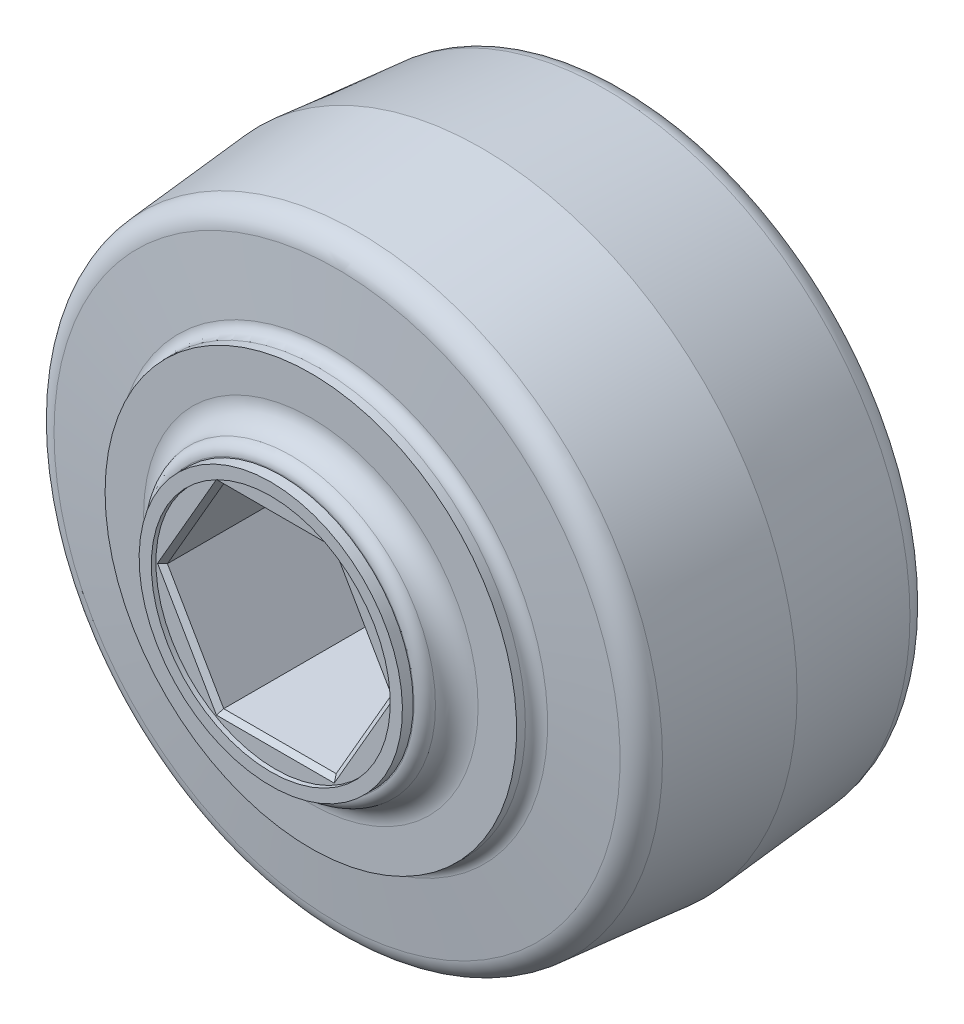
ISO-10303-21;
HEADER;
FILE_DESCRIPTION(('STEP AP214'),'2;1');
FILE_NAME('part.step','',(''),(''),'','','');
FILE_SCHEMA(('AUTOMOTIVE_DESIGN { 1 0 10303 214 1 1 1 1 }'));
ENDSEC;
DATA;
#1=APPLICATION_CONTEXT('core data for automotive mechanical design processes');
#2=APPLICATION_PROTOCOL_DEFINITION('international standard','automotive_design',2000,#1);
#3=PRODUCT_CONTEXT('',#1,'mechanical');
#4=PRODUCT('Part','Part','',(#3));
#5=PRODUCT_RELATED_PRODUCT_CATEGORY('part','',(#4));
#6=PRODUCT_DEFINITION_FORMATION('','',#4);
#7=PRODUCT_DEFINITION_CONTEXT('part definition',#1,'design');
#8=PRODUCT_DEFINITION('design','',#6,#7);
#9=PRODUCT_DEFINITION_SHAPE('','',#8);
#10=(LENGTH_UNIT() NAMED_UNIT(*) SI_UNIT(.MILLI.,.METRE.));
#11=(NAMED_UNIT(*) PLANE_ANGLE_UNIT() SI_UNIT($,.RADIAN.));
#12=(NAMED_UNIT(*) SI_UNIT($,.STERADIAN.) SOLID_ANGLE_UNIT());
#13=UNCERTAINTY_MEASURE_WITH_UNIT(LENGTH_MEASURE(1.E-05),#10,'distance_accuracy_value','');
#14=(GEOMETRIC_REPRESENTATION_CONTEXT(3) GLOBAL_UNCERTAINTY_ASSIGNED_CONTEXT((#13)) GLOBAL_UNIT_ASSIGNED_CONTEXT((#10,
#11,#12)) REPRESENTATION_CONTEXT('',''));
#15=CARTESIAN_POINT('',(0.,0.,0.));
#16=DIRECTION('',(0.,0.,1.));
#17=DIRECTION('',(1.,0.,0.));
#18=AXIS2_PLACEMENT_3D('',#15,#16,#17);
#19=CARTESIAN_POINT('',(-3.67350655777283,-6.3627,13.49375));
#20=DIRECTION('',(0.,1.,0.));
#21=DIRECTION('',(-1.,0.,0.));
#22=AXIS2_PLACEMENT_3D('',#19,#20,#21);
#23=PLANE('',#22);
#24=DIRECTION('',(0.,0.,1.));
#25=VECTOR('',#24,1.);
#26=CARTESIAN_POINT('',(3.67350655777283,-6.3627,13.49375));
#27=LINE('',#26,#25);
#28=CARTESIAN_POINT('',(3.67350655777283,-6.3627,-13.19375));
#29=VERTEX_POINT('',#28);
#30=CARTESIAN_POINT('',(3.67350655777283,-6.3627,13.19375));
#31=VERTEX_POINT('',#30);
#32=EDGE_CURVE('E120',#29,#31,#27,.T.);
#33=ORIENTED_EDGE('',*,*,#32,.F.);
#34=DIRECTION('',(1.,0.,0.));
#35=VECTOR('',#34,1.);
#36=CARTESIAN_POINT('',(0.,-6.3627,-13.19375));
#37=LINE('',#36,#35);
#38=CARTESIAN_POINT('',(-3.67350655777283,-6.3627,-13.19375));
#39=VERTEX_POINT('',#38);
#40=EDGE_CURVE('E264',#39,#29,#37,.T.);
#41=ORIENTED_EDGE('',*,*,#40,.F.);
#42=DIRECTION('',(0.,0.,1.));
#43=VECTOR('',#42,1.);
#44=CARTESIAN_POINT('',(-3.67350655777282,-6.3627,13.49375));
#45=LINE('',#44,#43);
#46=CARTESIAN_POINT('',(-3.67350655777283,-6.3627,13.19375));
#47=VERTEX_POINT('',#46);
#48=EDGE_CURVE('E154',#47,#39,#45,.F.);
#49=ORIENTED_EDGE('',*,*,#48,.F.);
#50=DIRECTION('',(1.,0.,0.));
#51=VECTOR('',#50,1.);
#52=CARTESIAN_POINT('',(-3.67350655777283,-6.3627,13.19375));
#53=LINE('',#52,#51);
#54=EDGE_CURVE('E280',#47,#31,#53,.T.);
#55=ORIENTED_EDGE('',*,*,#54,.T.);
#56=EDGE_LOOP('',(#33,#41,#49,#55));
#57=FACE_BOUND('',#56,.T.);
#58=ADVANCED_FACE('F17',(#57),#23,.T.);
#59=CARTESIAN_POINT('',(-7.34701311554566,0.,13.49375));
#60=DIRECTION('',(0.866025403784439,0.5,0.));
#61=DIRECTION('',(-0.5,0.866025403784439,0.));
#62=AXIS2_PLACEMENT_3D('',#59,#60,#61);
#63=PLANE('',#62);
#64=ORIENTED_EDGE('',*,*,#48,.T.);
#65=DIRECTION('',(0.5,-0.866025403784438,0.));
#66=VECTOR('',#65,1.);
#67=CARTESIAN_POINT('',(-7.34701311554566,0.,-13.19375));
#68=LINE('',#67,#66);
#69=CARTESIAN_POINT('',(-7.34701311554566,0.,-13.19375));
#70=VERTEX_POINT('',#69);
#71=EDGE_CURVE('E261',#70,#39,#68,.T.);
#72=ORIENTED_EDGE('',*,*,#71,.F.);
#73=DIRECTION('',(0.,0.,1.));
#74=VECTOR('',#73,1.);
#75=CARTESIAN_POINT('',(-7.34701311554566,0.,13.49375));
#76=LINE('',#75,#74);
#77=CARTESIAN_POINT('',(-7.34701311554566,0.,13.19375));
#78=VERTEX_POINT('',#77);
#79=EDGE_CURVE('E151',#78,#70,#76,.F.);
#80=ORIENTED_EDGE('',*,*,#79,.F.);
#81=DIRECTION('',(0.5,-0.866025403784438,0.));
#82=VECTOR('',#81,1.);
#83=CARTESIAN_POINT('',(-7.34701311554566,0.,13.19375));
#84=LINE('',#83,#82);
#85=EDGE_CURVE('E275',#78,#47,#84,.T.);
#86=ORIENTED_EDGE('',*,*,#85,.T.);
#87=EDGE_LOOP('',(#64,#72,#80,#86));
#88=FACE_BOUND('',#87,.T.);
#89=ADVANCED_FACE('F303',(#88),#63,.T.);
#90=CARTESIAN_POINT('',(-3.67350655777283,6.3627,13.49375));
#91=DIRECTION('',(0.866025403784439,-0.5,0.));
#92=DIRECTION('',(0.5,0.866025403784439,0.));
#93=AXIS2_PLACEMENT_3D('',#90,#91,#92);
#94=PLANE('',#93);
#95=ORIENTED_EDGE('',*,*,#79,.T.);
#96=DIRECTION('',(-0.5,-0.866025403784439,0.));
#97=VECTOR('',#96,1.);
#98=CARTESIAN_POINT('',(-3.67350655777283,6.3627,-13.19375));
#99=LINE('',#98,#97);
#100=CARTESIAN_POINT('',(-3.67350655777283,6.3627,-13.19375));
#101=VERTEX_POINT('',#100);
#102=EDGE_CURVE('E252',#101,#70,#99,.T.);
#103=ORIENTED_EDGE('',*,*,#102,.F.);
#104=DIRECTION('',(0.,0.,1.));
#105=VECTOR('',#104,1.);
#106=CARTESIAN_POINT('',(-3.67350655777283,6.3627,13.49375));
#107=LINE('',#106,#105);
#108=CARTESIAN_POINT('',(-3.67350655777283,6.3627,13.19375));
#109=VERTEX_POINT('',#108);
#110=EDGE_CURVE('E121',#109,#101,#107,.F.);
#111=ORIENTED_EDGE('',*,*,#110,.F.);
#112=DIRECTION('',(-0.5,-0.866025403784439,0.));
#113=VECTOR('',#112,1.);
#114=CARTESIAN_POINT('',(-3.67350655777283,6.3627,13.19375));
#115=LINE('',#114,#113);
#116=EDGE_CURVE('E269',#109,#78,#115,.T.);
#117=ORIENTED_EDGE('',*,*,#116,.T.);
#118=EDGE_LOOP('',(#95,#103,#111,#117));
#119=FACE_BOUND('',#118,.T.);
#120=ADVANCED_FACE('F296',(#119),#94,.T.);
#121=CARTESIAN_POINT('',(3.67350655777283,6.3627,13.49375));
#122=DIRECTION('',(0.,-1.,0.));
#123=DIRECTION('',(1.,0.,0.));
#124=AXIS2_PLACEMENT_3D('',#121,#122,#123);
#125=PLANE('',#124);
#126=ORIENTED_EDGE('',*,*,#110,.T.);
#127=DIRECTION('',(1.,0.,0.));
#128=VECTOR('',#127,1.);
#129=CARTESIAN_POINT('',(0.,6.3627,-13.19375));
#130=LINE('',#129,#128);
#131=CARTESIAN_POINT('',(3.67350655777283,6.3627,-13.19375));
#132=VERTEX_POINT('',#131);
#133=EDGE_CURVE('E118',#132,#101,#130,.F.);
#134=ORIENTED_EDGE('',*,*,#133,.F.);
#135=DIRECTION('',(0.,0.,1.));
#136=VECTOR('',#135,1.);
#137=CARTESIAN_POINT('',(3.67350655777283,6.3627,13.49375));
#138=LINE('',#137,#136);
#139=CARTESIAN_POINT('',(3.67350655777283,6.3627,13.19375));
#140=VERTEX_POINT('',#139);
#141=EDGE_CURVE('E111',#140,#132,#138,.F.);
#142=ORIENTED_EDGE('',*,*,#141,.F.);
#143=DIRECTION('',(1.,0.,0.));
#144=VECTOR('',#143,1.);
#145=CARTESIAN_POINT('',(3.67350655777283,6.3627,13.19375));
#146=LINE('',#145,#144);
#147=EDGE_CURVE('E115',#140,#109,#146,.F.);
#148=ORIENTED_EDGE('',*,*,#147,.T.);
#149=EDGE_LOOP('',(#126,#134,#142,#148));
#150=FACE_BOUND('',#149,.T.);
#151=ADVANCED_FACE('F113',(#150),#125,.T.);
#152=CARTESIAN_POINT('',(7.34701311554566,0.,13.49375));
#153=DIRECTION('',(-0.866025403784439,-0.5,0.));
#154=DIRECTION('',(0.5,-0.866025403784439,0.));
#155=AXIS2_PLACEMENT_3D('',#152,#153,#154);
#156=PLANE('',#155);
#157=ORIENTED_EDGE('',*,*,#141,.T.);
#158=DIRECTION('',(-0.5,0.866025403784439,0.));
#159=VECTOR('',#158,1.);
#160=CARTESIAN_POINT('',(7.34701311554566,0.,-13.19375));
#161=LINE('',#160,#159);
#162=CARTESIAN_POINT('',(7.34701311554566,0.,-13.19375));
#163=VERTEX_POINT('',#162);
#164=EDGE_CURVE('E245',#163,#132,#161,.T.);
#165=ORIENTED_EDGE('',*,*,#164,.F.);
#166=DIRECTION('',(0.,0.,1.));
#167=VECTOR('',#166,1.);
#168=CARTESIAN_POINT('',(7.34701311554566,0.,13.49375));
#169=LINE('',#168,#167);
#170=CARTESIAN_POINT('',(7.34701311554566,0.,13.19375));
#171=VERTEX_POINT('',#170);
#172=EDGE_CURVE('E105',#171,#163,#169,.F.);
#173=ORIENTED_EDGE('',*,*,#172,.F.);
#174=DIRECTION('',(-0.5,0.866025403784439,0.));
#175=VECTOR('',#174,1.);
#176=CARTESIAN_POINT('',(7.34701311554566,0.,13.19375));
#177=LINE('',#176,#175);
#178=EDGE_CURVE('E124',#171,#140,#177,.T.);
#179=ORIENTED_EDGE('',*,*,#178,.T.);
#180=EDGE_LOOP('',(#157,#165,#173,#179));
#181=FACE_BOUND('',#180,.T.);
#182=ADVANCED_FACE('F125',(#181),#156,.T.);
#183=CARTESIAN_POINT('',(3.67350655777283,-6.3627,13.49375));
#184=DIRECTION('',(-0.866025403784439,0.5,0.));
#185=DIRECTION('',(-0.5,-0.866025403784439,0.));
#186=AXIS2_PLACEMENT_3D('',#183,#184,#185);
#187=PLANE('',#186);
#188=ORIENTED_EDGE('',*,*,#172,.T.);
#189=DIRECTION('',(0.5,0.866025403784439,0.));
#190=VECTOR('',#189,1.);
#191=CARTESIAN_POINT('',(3.67350655777283,-6.3627,-13.19375));
#192=LINE('',#191,#190);
#193=EDGE_CURVE('E238',#29,#163,#192,.T.);
#194=ORIENTED_EDGE('',*,*,#193,.F.);
#195=ORIENTED_EDGE('',*,*,#32,.T.);
#196=DIRECTION('',(0.5,0.866025403784439,0.));
#197=VECTOR('',#196,1.);
#198=CARTESIAN_POINT('',(3.67350655777283,-6.3627,13.19375));
#199=LINE('',#198,#197);
#200=EDGE_CURVE('E142',#31,#171,#199,.T.);
#201=ORIENTED_EDGE('',*,*,#200,.T.);
#202=EDGE_LOOP('',(#188,#194,#195,#201));
#203=FACE_BOUND('',#202,.T.);
#204=ADVANCED_FACE('F309',(#203),#187,.T.);
#205=CARTESIAN_POINT('',(3.67350655777283,6.3627,13.19375));
#206=DIRECTION('',(0.,0.707106781186548,-0.707106781186547));
#207=DIRECTION('',(0.,0.707106781186547,0.707106781186548));
#208=AXIS2_PLACEMENT_3D('',#205,#206,#207);
#209=PLANE('',#208);
#210=ORIENTED_EDGE('',*,*,#147,.F.);
#211=DIRECTION('',(0.377964473009226,0.654653670707977,0.654653670707977));
#212=VECTOR('',#211,1.);
#213=CARTESIAN_POINT('',(3.67350655777283,6.3627,13.19375));
#214=LINE('',#213,#212);
#215=CARTESIAN_POINT('',(3.84671163852972,6.6627,13.49375));
#216=VERTEX_POINT('',#215);
#217=EDGE_CURVE('E129',#140,#216,#214,.T.);
#218=ORIENTED_EDGE('',*,*,#217,.T.);
#219=DIRECTION('',(1.,0.,0.));
#220=VECTOR('',#219,1.);
#221=CARTESIAN_POINT('',(0.,6.6627,13.49375));
#222=LINE('',#221,#220);
#223=CARTESIAN_POINT('',(-3.84671163852972,6.6627,13.49375));
#224=VERTEX_POINT('',#223);
#225=EDGE_CURVE('E234',#224,#216,#222,.T.);
#226=ORIENTED_EDGE('',*,*,#225,.F.);
#227=DIRECTION('',(0.377964473009227,-0.654653670707975,-0.654653670707979));
#228=VECTOR('',#227,1.);
#229=CARTESIAN_POINT('',(-3.84671163852972,6.6627,13.49375));
#230=LINE('',#229,#228);
#231=EDGE_CURVE('E135',#224,#109,#230,.T.);
#232=ORIENTED_EDGE('',*,*,#231,.T.);
#233=EDGE_LOOP('',(#210,#218,#226,#232));
#234=FACE_BOUND('',#233,.T.);
#235=ADVANCED_FACE('F132',(#234),#209,.F.);
#236=CARTESIAN_POINT('',(7.34701311554566,0.,13.19375));
#237=DIRECTION('',(0.612372435695795,0.353553390593274,-0.707106781186547));
#238=DIRECTION('',(-0.755928946018454,0.,-0.654653670707978));
#239=AXIS2_PLACEMENT_3D('',#236,#237,#238);
#240=PLANE('',#239);
#241=DIRECTION('',(0.5,-0.866025403784439,0.));
#242=VECTOR('',#241,1.);
#243=CARTESIAN_POINT('',(3.84671163852972,6.6627,13.49375));
#244=LINE('',#243,#242);
#245=CARTESIAN_POINT('',(7.69342327705944,0.,13.49375));
#246=VERTEX_POINT('',#245);
#247=EDGE_CURVE('E140',#216,#246,#244,.T.);
#248=ORIENTED_EDGE('',*,*,#247,.F.);
#249=ORIENTED_EDGE('',*,*,#217,.F.);
#250=ORIENTED_EDGE('',*,*,#178,.F.);
#251=DIRECTION('',(-0.755928946018454,0.,-0.654653670707977));
#252=VECTOR('',#251,1.);
#253=CARTESIAN_POINT('',(5.24786651110404,0.,11.3758357142857));
#254=LINE('',#253,#252);
#255=EDGE_CURVE('E144',#171,#246,#254,.F.);
#256=ORIENTED_EDGE('',*,*,#255,.T.);
#257=EDGE_LOOP('',(#248,#249,#250,#256));
#258=FACE_BOUND('',#257,.T.);
#259=ADVANCED_FACE('F138',(#258),#240,.F.);
#260=CARTESIAN_POINT('',(3.67350655777283,-6.3627,13.19375));
#261=DIRECTION('',(0.612372435695795,-0.353553390593274,-0.707106781186548));
#262=DIRECTION('',(-0.755928946018454,0.,-0.654653670707977));
#263=AXIS2_PLACEMENT_3D('',#260,#261,#262);
#264=PLANE('',#263);
#265=DIRECTION('',(-0.5,-0.866025403784439,0.));
#266=VECTOR('',#265,1.);
#267=CARTESIAN_POINT('',(7.69342327705944,0.,13.49375));
#268=LINE('',#267,#266);
#269=CARTESIAN_POINT('',(3.84671163852972,-6.6627,13.49375));
#270=VERTEX_POINT('',#269);
#271=EDGE_CURVE('E230',#246,#270,#268,.T.);
#272=ORIENTED_EDGE('',*,*,#271,.F.);
#273=ORIENTED_EDGE('',*,*,#255,.F.);
#274=ORIENTED_EDGE('',*,*,#200,.F.);
#275=DIRECTION('',(0.377964473009226,-0.654653670707977,0.654653670707977));
#276=VECTOR('',#275,1.);
#277=CARTESIAN_POINT('',(3.67350655777283,-6.3627,13.19375));
#278=LINE('',#277,#276);
#279=EDGE_CURVE('E278',#31,#270,#278,.T.);
#280=ORIENTED_EDGE('',*,*,#279,.T.);
#281=EDGE_LOOP('',(#272,#273,#274,#280));
#282=FACE_BOUND('',#281,.T.);
#283=ADVANCED_FACE('F285',(#282),#264,.F.);
#284=CARTESIAN_POINT('',(-3.67350655777283,-6.3627,13.19375));
#285=DIRECTION('',(0.,-0.707106781186548,-0.707106781186547));
#286=DIRECTION('',(0.,0.707106781186547,-0.707106781186548));
#287=AXIS2_PLACEMENT_3D('',#284,#285,#286);
#288=PLANE('',#287);
#289=DIRECTION('',(1.,0.,0.));
#290=VECTOR('',#289,1.);
#291=CARTESIAN_POINT('',(0.,-6.6627,13.49375));
#292=LINE('',#291,#290);
#293=CARTESIAN_POINT('',(-3.84671163852971,-6.6627,13.49375));
#294=VERTEX_POINT('',#293);
#295=EDGE_CURVE('E227',#270,#294,#292,.F.);
#296=ORIENTED_EDGE('',*,*,#295,.F.);
#297=ORIENTED_EDGE('',*,*,#279,.F.);
#298=ORIENTED_EDGE('',*,*,#54,.F.);
#299=DIRECTION('',(-0.377964473009228,-0.654653670707974,0.65465367070798));
#300=VECTOR('',#299,1.);
#301=CARTESIAN_POINT('',(-3.67350655777282,-6.3627,13.19375));
#302=LINE('',#301,#300);
#303=EDGE_CURVE('E273',#47,#294,#302,.T.);
#304=ORIENTED_EDGE('',*,*,#303,.T.);
#305=EDGE_LOOP('',(#296,#297,#298,#304));
#306=FACE_BOUND('',#305,.T.);
#307=ADVANCED_FACE('F306',(#306),#288,.F.);
#308=CARTESIAN_POINT('',(-7.34701311554566,0.,13.19375));
#309=DIRECTION('',(-0.612372435695796,-0.353553390593275,-0.707106781186546));
#310=DIRECTION('',(-0.755928946018453,0.,0.654653670707979));
#311=AXIS2_PLACEMENT_3D('',#308,#309,#310);
#312=PLANE('',#311);
#313=DIRECTION('',(-0.5,0.866025403784439,0.));
#314=VECTOR('',#313,1.);
#315=CARTESIAN_POINT('',(-3.84671163852972,-6.6627,13.49375));
#316=LINE('',#315,#314);
#317=CARTESIAN_POINT('',(-7.69342327705944,0.,13.49375));
#318=VERTEX_POINT('',#317);
#319=EDGE_CURVE('E224',#294,#318,#316,.T.);
#320=ORIENTED_EDGE('',*,*,#319,.F.);
#321=ORIENTED_EDGE('',*,*,#303,.F.);
#322=ORIENTED_EDGE('',*,*,#85,.F.);
#323=DIRECTION('',(-0.755928946018454,0.,0.654653670707978));
#324=VECTOR('',#323,1.);
#325=CARTESIAN_POINT('',(-5.24786651110405,0.,11.3758357142857));
#326=LINE('',#325,#324);
#327=EDGE_CURVE('E267',#78,#318,#326,.T.);
#328=ORIENTED_EDGE('',*,*,#327,.T.);
#329=EDGE_LOOP('',(#320,#321,#322,#328));
#330=FACE_BOUND('',#329,.T.);
#331=ADVANCED_FACE('F300',(#330),#312,.F.);
#332=CARTESIAN_POINT('',(-3.67350655777283,6.3627,13.19375));
#333=DIRECTION('',(-0.612372435695795,0.353553390593274,-0.707106781186547));
#334=DIRECTION('',(-0.755928946018454,0.,0.654653670707978));
#335=AXIS2_PLACEMENT_3D('',#332,#333,#334);
#336=PLANE('',#335);
#337=ORIENTED_EDGE('',*,*,#116,.F.);
#338=ORIENTED_EDGE('',*,*,#231,.F.);
#339=DIRECTION('',(0.5,0.866025403784439,0.));
#340=VECTOR('',#339,1.);
#341=CARTESIAN_POINT('',(-7.69342327705944,0.,13.49375));
#342=LINE('',#341,#340);
#343=EDGE_CURVE('E221',#318,#224,#342,.T.);
#344=ORIENTED_EDGE('',*,*,#343,.F.);
#345=ORIENTED_EDGE('',*,*,#327,.F.);
#346=EDGE_LOOP('',(#337,#338,#344,#345));
#347=FACE_BOUND('',#346,.T.);
#348=ADVANCED_FACE('F292',(#347),#336,.F.);
#349=CARTESIAN_POINT('',(0.,-6.6627,-13.49375));
#350=DIRECTION('',(0.,0.707106781186556,-0.707106781186539));
#351=DIRECTION('',(0.,0.707106781186539,0.707106781186556));
#352=AXIS2_PLACEMENT_3D('',#349,#350,#351);
#353=PLANE('',#352);
#354=DIRECTION('',(-0.377964473009223,0.654653670707972,0.654653670707985));
#355=VECTOR('',#354,1.);
#356=CARTESIAN_POINT('',(3.84671163852972,-6.6627,-13.49375));
#357=LINE('',#356,#355);
#358=CARTESIAN_POINT('',(3.84671163852972,-6.66269999999999,-13.49375));
#359=VERTEX_POINT('',#358);
#360=EDGE_CURVE('E241',#359,#29,#357,.T.);
#361=ORIENTED_EDGE('',*,*,#360,.F.);
#362=DIRECTION('',(1.,0.,0.));
#363=VECTOR('',#362,1.);
#364=CARTESIAN_POINT('',(0.,-6.66269999999999,-13.49375));
#365=LINE('',#364,#363);
#366=CARTESIAN_POINT('',(-3.84671163852971,-6.6627,-13.49375));
#367=VERTEX_POINT('',#366);
#368=EDGE_CURVE('E219',#359,#367,#365,.F.);
#369=ORIENTED_EDGE('',*,*,#368,.T.);
#370=DIRECTION('',(-0.377964473009221,-0.654653670707972,-0.654653670707986));
#371=VECTOR('',#370,1.);
#372=CARTESIAN_POINT('',(-3.67350655777283,-6.3627,-13.19375));
#373=LINE('',#372,#371);
#374=EDGE_CURVE('E258',#39,#367,#373,.T.);
#375=ORIENTED_EDGE('',*,*,#374,.F.);
#376=ORIENTED_EDGE('',*,*,#40,.T.);
#377=EDGE_LOOP('',(#361,#369,#375,#376));
#378=FACE_BOUND('',#377,.T.);
#379=ADVANCED_FACE('F313',(#378),#353,.T.);
#380=CARTESIAN_POINT('',(-5.77006745779457,-3.33135,-13.49375));
#381=DIRECTION('',(0.612372435695803,0.353553390593279,-0.707106781186538));
#382=DIRECTION('',(-0.755928946018446,0.,-0.654653670707987));
#383=AXIS2_PLACEMENT_3D('',#380,#381,#382);
#384=PLANE('',#383);
#385=ORIENTED_EDGE('',*,*,#374,.T.);
#386=DIRECTION('',(-0.5,0.866025403784438,0.));
#387=VECTOR('',#386,1.);
#388=CARTESIAN_POINT('',(-3.84671163852971,-6.6627,-13.49375));
#389=LINE('',#388,#387);
#390=CARTESIAN_POINT('',(-7.69342327705943,0.,-13.49375));
#391=VERTEX_POINT('',#390);
#392=EDGE_CURVE('E217',#367,#391,#389,.T.);
#393=ORIENTED_EDGE('',*,*,#392,.T.);
#394=DIRECTION('',(-0.755928946018446,0.,-0.654653670707987));
#395=VECTOR('',#394,1.);
#396=CARTESIAN_POINT('',(-6.59436280890811,0.,-12.5419357142857));
#397=LINE('',#396,#395);
#398=EDGE_CURVE('E255',#70,#391,#397,.T.);
#399=ORIENTED_EDGE('',*,*,#398,.F.);
#400=ORIENTED_EDGE('',*,*,#71,.T.);
#401=EDGE_LOOP('',(#385,#393,#399,#400));
#402=FACE_BOUND('',#401,.T.);
#403=ADVANCED_FACE('F317',(#402),#384,.T.);
#404=CARTESIAN_POINT('',(-5.77006745779457,3.33135,-13.49375));
#405=DIRECTION('',(0.612372435695803,-0.353553390593278,-0.707106781186538));
#406=DIRECTION('',(-0.755928946018446,0.,-0.654653670707987));
#407=AXIS2_PLACEMENT_3D('',#404,#405,#406);
#408=PLANE('',#407);
#409=DIRECTION('',(-0.37796447300922,0.654653670707972,-0.654653670707987));
#410=VECTOR('',#409,1.);
#411=CARTESIAN_POINT('',(-3.67350655777283,6.3627,-13.19375));
#412=LINE('',#411,#410);
#413=CARTESIAN_POINT('',(-3.84671163852972,6.6627,-13.49375));
#414=VERTEX_POINT('',#413);
#415=EDGE_CURVE('E249',#101,#414,#412,.T.);
#416=ORIENTED_EDGE('',*,*,#415,.F.);
#417=ORIENTED_EDGE('',*,*,#102,.T.);
#418=ORIENTED_EDGE('',*,*,#398,.T.);
#419=DIRECTION('',(0.5,0.866025403784439,0.));
#420=VECTOR('',#419,1.);
#421=CARTESIAN_POINT('',(-7.69342327705943,0.,-13.49375));
#422=LINE('',#421,#420);
#423=EDGE_CURVE('E215',#391,#414,#422,.T.);
#424=ORIENTED_EDGE('',*,*,#423,.T.);
#425=EDGE_LOOP('',(#416,#417,#418,#424));
#426=FACE_BOUND('',#425,.T.);
#427=ADVANCED_FACE('F321',(#426),#408,.T.);
#428=CARTESIAN_POINT('',(0.,6.66269999999999,-13.49375));
#429=DIRECTION('',(0.,-0.707106781186556,-0.707106781186539));
#430=DIRECTION('',(0.,0.707106781186539,-0.707106781186556));
#431=AXIS2_PLACEMENT_3D('',#428,#429,#430);
#432=PLANE('',#431);
#433=DIRECTION('',(0.377964473009221,0.65465367070797,-0.654653670707988));
#434=VECTOR('',#433,1.);
#435=CARTESIAN_POINT('',(3.67350655777283,6.3627,-13.19375));
#436=LINE('',#435,#434);
#437=CARTESIAN_POINT('',(3.84671163852972,6.66269999999999,-13.49375));
#438=VERTEX_POINT('',#437);
#439=EDGE_CURVE('E243',#132,#438,#436,.T.);
#440=ORIENTED_EDGE('',*,*,#439,.F.);
#441=ORIENTED_EDGE('',*,*,#133,.T.);
#442=ORIENTED_EDGE('',*,*,#415,.T.);
#443=DIRECTION('',(1.,0.,0.));
#444=VECTOR('',#443,1.);
#445=CARTESIAN_POINT('',(0.,6.66269999999999,-13.49375));
#446=LINE('',#445,#444);
#447=EDGE_CURVE('E209',#414,#438,#446,.T.);
#448=ORIENTED_EDGE('',*,*,#447,.T.);
#449=EDGE_LOOP('',(#440,#441,#442,#448));
#450=FACE_BOUND('',#449,.T.);
#451=ADVANCED_FACE('F326',(#450),#432,.T.);
#452=CARTESIAN_POINT('',(5.77006745779457,3.33135,-13.49375));
#453=DIRECTION('',(-0.612372435695802,-0.353553390593278,-0.707106781186539));
#454=DIRECTION('',(-0.755928946018446,0.,0.654653670707987));
#455=AXIS2_PLACEMENT_3D('',#452,#453,#454);
#456=PLANE('',#455);
#457=ORIENTED_EDGE('',*,*,#439,.T.);
#458=DIRECTION('',(0.5,-0.866025403784438,0.));
#459=VECTOR('',#458,1.);
#460=CARTESIAN_POINT('',(3.84671163852971,6.66269999999999,-13.49375));
#461=LINE('',#460,#459);
#462=CARTESIAN_POINT('',(7.69342327705943,0.,-13.49375));
#463=VERTEX_POINT('',#462);
#464=EDGE_CURVE('E36',#438,#463,#461,.T.);
#465=ORIENTED_EDGE('',*,*,#464,.T.);
#466=DIRECTION('',(-0.755928946018447,0.,0.654653670707986));
#467=VECTOR('',#466,1.);
#468=CARTESIAN_POINT('',(6.59436280890811,0.,-12.5419357142857));
#469=LINE('',#468,#467);
#470=EDGE_CURVE('E236',#163,#463,#469,.F.);
#471=ORIENTED_EDGE('',*,*,#470,.F.);
#472=ORIENTED_EDGE('',*,*,#164,.T.);
#473=EDGE_LOOP('',(#457,#465,#471,#472));
#474=FACE_BOUND('',#473,.T.);
#475=ADVANCED_FACE('F327',(#474),#456,.T.);
#476=CARTESIAN_POINT('',(5.77006745779458,-3.33135,-13.49375));
#477=DIRECTION('',(-0.612372435695802,0.353553390593278,-0.707106781186539));
#478=DIRECTION('',(-0.755928946018447,0.,0.654653670707986));
#479=AXIS2_PLACEMENT_3D('',#476,#477,#478);
#480=PLANE('',#479);
#481=ORIENTED_EDGE('',*,*,#470,.T.);
#482=DIRECTION('',(-0.5,-0.866025403784439,0.));
#483=VECTOR('',#482,1.);
#484=CARTESIAN_POINT('',(7.69342327705943,0.,-13.49375));
#485=LINE('',#484,#483);
#486=EDGE_CURVE('E200',#463,#359,#485,.T.);
#487=ORIENTED_EDGE('',*,*,#486,.T.);
#488=ORIENTED_EDGE('',*,*,#360,.T.);
#489=ORIENTED_EDGE('',*,*,#193,.T.);
#490=EDGE_LOOP('',(#481,#487,#488,#489));
#491=FACE_BOUND('',#490,.T.);
#492=ADVANCED_FACE('F311',(#491),#480,.T.);
#493=CARTESIAN_POINT('',(0.,0.,13.49375));
#494=DIRECTION('',(0.,0.,1.));
#495=DIRECTION('',(1.,0.,0.));
#496=AXIS2_PLACEMENT_3D('',#493,#494,#495);
#497=PLANE('',#496);
#498=CARTESIAN_POINT('',(0.,0.,13.49375));
#499=DIRECTION('',(0.,0.,1.));
#500=DIRECTION('',(0.,-1.,0.));
#501=AXIS2_PLACEMENT_3D('',#498,#499,#500);
#502=CIRCLE('',#501,7.8);
#503=CARTESIAN_POINT('',(0.,-7.8,13.49375));
#504=VERTEX_POINT('',#503);
#505=EDGE_CURVE('E21',#504,#504,#502,.T.);
#506=ORIENTED_EDGE('',*,*,#505,.T.);
#507=EDGE_LOOP('',(#506));
#508=FACE_BOUND('',#507,.T.);
#509=ORIENTED_EDGE('',*,*,#319,.T.);
#510=ORIENTED_EDGE('',*,*,#343,.T.);
#511=ORIENTED_EDGE('',*,*,#225,.T.);
#512=ORIENTED_EDGE('',*,*,#247,.T.);
#513=ORIENTED_EDGE('',*,*,#271,.T.);
#514=ORIENTED_EDGE('',*,*,#295,.T.);
#515=EDGE_LOOP('',(#509,#510,#511,#512,#513,#514));
#516=FACE_BOUND('',#515,.T.);
#517=ADVANCED_FACE('F289',(#508,#516),#497,.T.);
#518=CARTESIAN_POINT('',(0.,0.,-13.49375));
#519=DIRECTION('',(0.,0.,1.));
#520=DIRECTION('',(1.,0.,0.));
#521=AXIS2_PLACEMENT_3D('',#518,#519,#520);
#522=PLANE('',#521);
#523=ORIENTED_EDGE('',*,*,#464,.F.);
#524=ORIENTED_EDGE('',*,*,#447,.F.);
#525=ORIENTED_EDGE('',*,*,#423,.F.);
#526=ORIENTED_EDGE('',*,*,#392,.F.);
#527=ORIENTED_EDGE('',*,*,#368,.F.);
#528=ORIENTED_EDGE('',*,*,#486,.F.);
#529=EDGE_LOOP('',(#523,#524,#525,#526,#527,#528));
#530=FACE_BOUND('',#529,.T.);
#531=CARTESIAN_POINT('',(0.,0.,-13.49375));
#532=DIRECTION('',(0.,0.,-1.));
#533=DIRECTION('',(0.,1.,0.));
#534=AXIS2_PLACEMENT_3D('',#531,#532,#533);
#535=CIRCLE('',#534,7.8);
#536=CARTESIAN_POINT('',(0.,7.8,-13.49375));
#537=VERTEX_POINT('',#536);
#538=EDGE_CURVE('E195',#537,#537,#535,.T.);
#539=ORIENTED_EDGE('',*,*,#538,.T.);
#540=EDGE_LOOP('',(#539));
#541=FACE_BOUND('',#540,.T.);
#542=ADVANCED_FACE('F324',(#530,#541),#522,.F.);
#543=CARTESIAN_POINT('',(0.,0.,13.7937499999999));
#544=DIRECTION('',(0.,0.,1.));
#545=DIRECTION('',(0.,-1.,0.));
#546=AXIS2_PLACEMENT_3D('',#543,#544,#545);
#547=CONICAL_SURFACE('',#546,7.80261806033723,0.00872664625996963);
#548=ORIENTED_EDGE('',*,*,#505,.F.);
#549=EDGE_LOOP('',(#548));
#550=FACE_BOUND('',#549,.T.);
#551=CARTESIAN_POINT('',(0.,0.,13.7937499999999));
#552=DIRECTION('',(0.,0.,1.));
#553=DIRECTION('',(0.,-1.,0.));
#554=AXIS2_PLACEMENT_3D('',#551,#552,#553);
#555=CIRCLE('',#554,7.80261806033723);
#556=CARTESIAN_POINT('',(0.,-7.80261806033723,13.7937499999999));
#557=VERTEX_POINT('',#556);
#558=EDGE_CURVE('E193',#557,#557,#555,.F.);
#559=ORIENTED_EDGE('',*,*,#558,.F.);
#560=EDGE_LOOP('',(#559));
#561=FACE_BOUND('',#560,.T.);
#562=ADVANCED_FACE('F406',(#550,#561),#547,.F.);
#563=CARTESIAN_POINT('',(0.,0.,-13.7937499999999));
#564=DIRECTION('',(0.,0.,-1.));
#565=DIRECTION('',(0.,1.,0.));
#566=AXIS2_PLACEMENT_3D('',#563,#564,#565);
#567=CONICAL_SURFACE('',#566,7.80261806033723,0.00872664625996963);
#568=CARTESIAN_POINT('',(0.,0.,-13.7937499999999));
#569=DIRECTION('',(0.,0.,-1.));
#570=DIRECTION('',(0.,1.,0.));
#571=AXIS2_PLACEMENT_3D('',#568,#569,#570);
#572=CIRCLE('',#571,7.80261806033723);
#573=CARTESIAN_POINT('',(0.,7.80261806033723,-13.7937499999999));
#574=VERTEX_POINT('',#573);
#575=EDGE_CURVE('E190',#574,#574,#572,.F.);
#576=ORIENTED_EDGE('',*,*,#575,.F.);
#577=EDGE_LOOP('',(#576));
#578=FACE_BOUND('',#577,.T.);
#579=ORIENTED_EDGE('',*,*,#538,.F.);
#580=EDGE_LOOP('',(#579));
#581=FACE_BOUND('',#580,.T.);
#582=ADVANCED_FACE('F402',(#578,#581),#567,.F.);
#583=CARTESIAN_POINT('',(0.,0.,13.79375));
#584=DIRECTION('',(0.,0.,1.));
#585=DIRECTION('',(1.,0.,0.));
#586=AXIS2_PLACEMENT_3D('',#583,#584,#585);
#587=PLANE('',#586);
#588=CARTESIAN_POINT('',(0.,0.,13.7937499999999));
#589=DIRECTION('',(0.,0.,-1.));
#590=DIRECTION('',(0.,1.,0.));
#591=AXIS2_PLACEMENT_3D('',#588,#589,#590);
#592=CIRCLE('',#591,8.59738193966277);
#593=CARTESIAN_POINT('',(0.,8.59738193966277,13.7937499999999));
#594=VERTEX_POINT('',#593);
#595=EDGE_CURVE('E187',#594,#594,#592,.T.);
#596=ORIENTED_EDGE('',*,*,#595,.F.);
#597=EDGE_LOOP('',(#596));
#598=FACE_BOUND('',#597,.T.);
#599=ORIENTED_EDGE('',*,*,#558,.T.);
#600=EDGE_LOOP('',(#599));
#601=FACE_BOUND('',#600,.T.);
#602=ADVANCED_FACE('F398',(#598,#601),#587,.T.);
#603=CARTESIAN_POINT('',(0.,0.,-13.79375));
#604=DIRECTION('',(0.,0.,-1.));
#605=DIRECTION('',(-1.,0.,0.));
#606=AXIS2_PLACEMENT_3D('',#603,#604,#605);
#607=PLANE('',#606);
#608=ORIENTED_EDGE('',*,*,#575,.T.);
#609=EDGE_LOOP('',(#608));
#610=FACE_BOUND('',#609,.T.);
#611=CARTESIAN_POINT('',(0.,0.,-13.7937499999999));
#612=DIRECTION('',(0.,0.,1.));
#613=DIRECTION('',(0.,-1.,0.));
#614=AXIS2_PLACEMENT_3D('',#611,#612,#613);
#615=CIRCLE('',#614,8.59738193966277);
#616=CARTESIAN_POINT('',(0.,-8.59738193966277,-13.7937499999999));
#617=VERTEX_POINT('',#616);
#618=EDGE_CURVE('E184',#617,#617,#615,.T.);
#619=ORIENTED_EDGE('',*,*,#618,.F.);
#620=EDGE_LOOP('',(#619));
#621=FACE_BOUND('',#620,.T.);
#622=ADVANCED_FACE('F394',(#610,#621),#607,.T.);
#623=CARTESIAN_POINT('',(0.,0.,13.0937));
#624=DIRECTION('',(0.,0.,-1.));
#625=DIRECTION('',(0.,1.,0.));
#626=AXIS2_PLACEMENT_3D('',#623,#624,#625);
#627=CONICAL_SURFACE('',#626,8.60349118345969,0.00872664625997224);
#628=ORIENTED_EDGE('',*,*,#595,.T.);
#629=EDGE_LOOP('',(#628));
#630=FACE_BOUND('',#629,.T.);
#631=CARTESIAN_POINT('',(0.,0.,13.0937));
#632=DIRECTION('',(0.,0.,-1.));
#633=DIRECTION('',(0.,1.,0.));
#634=AXIS2_PLACEMENT_3D('',#631,#632,#633);
#635=CIRCLE('',#634,8.60349118345969);
#636=CARTESIAN_POINT('',(0.,8.60349118345969,13.0937));
#637=VERTEX_POINT('',#636);
#638=EDGE_CURVE('E181',#637,#637,#635,.F.);
#639=ORIENTED_EDGE('',*,*,#638,.T.);
#640=EDGE_LOOP('',(#639));
#641=FACE_BOUND('',#640,.T.);
#642=ADVANCED_FACE('F390',(#630,#641),#627,.T.);
#643=CARTESIAN_POINT('',(0.,0.,-13.0937));
#644=DIRECTION('',(0.,0.,1.));
#645=DIRECTION('',(0.,-1.,0.));
#646=AXIS2_PLACEMENT_3D('',#643,#644,#645);
#647=CONICAL_SURFACE('',#646,8.60349118345969,0.00872664625997224);
#648=ORIENTED_EDGE('',*,*,#618,.T.);
#649=EDGE_LOOP('',(#648));
#650=FACE_BOUND('',#649,.T.);
#651=CARTESIAN_POINT('',(0.,0.,-13.0937));
#652=DIRECTION('',(0.,0.,1.));
#653=DIRECTION('',(0.,-1.,0.));
#654=AXIS2_PLACEMENT_3D('',#651,#652,#653);
#655=CIRCLE('',#654,8.60349118345969);
#656=CARTESIAN_POINT('',(0.,-8.60349118345969,-13.0937));
#657=VERTEX_POINT('',#656);
#658=EDGE_CURVE('E178',#657,#657,#655,.T.);
#659=ORIENTED_EDGE('',*,*,#658,.F.);
#660=EDGE_LOOP('',(#659));
#661=FACE_BOUND('',#660,.T.);
#662=ADVANCED_FACE('F386',(#650,#661),#647,.T.);
#663=CARTESIAN_POINT('',(0.,6.35,13.0937));
#664=DIRECTION('',(0.,0.,-1.));
#665=DIRECTION('',(-1.,0.,0.));
#666=AXIS2_PLACEMENT_3D('',#663,#664,#665);
#667=PLANE('',#666);
#668=ORIENTED_EDGE('',*,*,#638,.F.);
#669=EDGE_LOOP('',(#668));
#670=FACE_BOUND('',#669,.T.);
#671=CARTESIAN_POINT('',(0.,0.,13.0937));
#672=DIRECTION('',(0.,0.,1.));
#673=DIRECTION('',(1.,0.,0.));
#674=AXIS2_PLACEMENT_3D('',#671,#672,#673);
#675=CIRCLE('',#674,8.66586367654745);
#676=CARTESIAN_POINT('',(8.66586367654745,0.,13.0937));
#677=VERTEX_POINT('',#676);
#678=EDGE_CURVE('E175',#677,#677,#675,.F.);
#679=ORIENTED_EDGE('',*,*,#678,.F.);
#680=EDGE_LOOP('',(#679));
#681=FACE_BOUND('',#680,.T.);
#682=ADVANCED_FACE('F382',(#670,#681),#667,.F.);
#683=CARTESIAN_POINT('',(0.,6.35,-13.0937));
#684=DIRECTION('',(0.,0.,-1.));
#685=DIRECTION('',(-1.,0.,0.));
#686=AXIS2_PLACEMENT_3D('',#683,#684,#685);
#687=PLANE('',#686);
#688=ORIENTED_EDGE('',*,*,#658,.T.);
#689=EDGE_LOOP('',(#688));
#690=FACE_BOUND('',#689,.T.);
#691=CARTESIAN_POINT('',(0.,0.,-13.0937));
#692=DIRECTION('',(0.,0.,1.));
#693=DIRECTION('',(0.,-1.,0.));
#694=AXIS2_PLACEMENT_3D('',#691,#692,#693);
#695=CIRCLE('',#694,8.66586367654745);
#696=CARTESIAN_POINT('',(0.,-8.66586367654745,-13.0937));
#697=VERTEX_POINT('',#696);
#698=EDGE_CURVE('E171',#697,#697,#695,.T.);
#699=ORIENTED_EDGE('',*,*,#698,.F.);
#700=EDGE_LOOP('',(#699));
#701=FACE_BOUND('',#700,.T.);
#702=ADVANCED_FACE('F378',(#690,#701),#687,.T.);
#703=CARTESIAN_POINT('',(0.,0.,12.3317));
#704=DIRECTION('',(0.,0.,1.));
#705=DIRECTION('',(1.,0.,0.));
#706=AXIS2_PLACEMENT_3D('',#703,#704,#705);
#707=TOROIDAL_SURFACE('',#706,8.66586367654745,0.761999999999998);
#708=CARTESIAN_POINT('',(0.,0.,12.4544666666658));
#709=DIRECTION('',(0.,0.,1.));
#710=DIRECTION('',(0.,-1.,0.));
#711=AXIS2_PLACEMENT_3D('',#708,#709,#710);
#712=CIRCLE('',#711,9.4179091176983);
#713=CARTESIAN_POINT('',(0.,-9.4179091176983,12.4544666666658));
#714=VERTEX_POINT('',#713);
#715=EDGE_CURVE('E174',#714,#714,#712,.T.);
#716=ORIENTED_EDGE('',*,*,#715,.T.);
#717=EDGE_LOOP('',(#716));
#718=FACE_BOUND('',#717,.T.);
#719=ORIENTED_EDGE('',*,*,#678,.T.);
#720=EDGE_LOOP('',(#719));
#721=FACE_BOUND('',#720,.T.);
#722=ADVANCED_FACE('F381',(#718,#721),#707,.T.);
#723=CARTESIAN_POINT('',(0.,0.,-12.3317));
#724=DIRECTION('',(0.,0.,1.));
#725=DIRECTION('',(0.,-1.,0.));
#726=AXIS2_PLACEMENT_3D('',#723,#724,#725);
#727=TOROIDAL_SURFACE('',#726,8.66586367654745,0.761999999999998);
#728=CARTESIAN_POINT('',(0.,0.,-12.4544666666658));
#729=DIRECTION('',(0.,0.,-1.));
#730=DIRECTION('',(0.,1.,0.));
#731=AXIS2_PLACEMENT_3D('',#728,#729,#730);
#732=CIRCLE('',#731,9.4179091176983);
#733=CARTESIAN_POINT('',(0.,9.4179091176983,-12.4544666666658));
#734=VERTEX_POINT('',#733);
#735=EDGE_CURVE('E170',#734,#734,#732,.T.);
#736=ORIENTED_EDGE('',*,*,#735,.T.);
#737=EDGE_LOOP('',(#736));
#738=FACE_BOUND('',#737,.T.);
#739=ORIENTED_EDGE('',*,*,#698,.T.);
#740=EDGE_LOOP('',(#739));
#741=FACE_BOUND('',#740,.T.);
#742=ADVANCED_FACE('F462',(#738,#741),#727,.T.);
#743=CARTESIAN_POINT('',(0.,0.,12.6999999999973));
#744=DIRECTION('',(0.,0.,-1.));
#745=DIRECTION('',(0.,1.,0.));
#746=AXIS2_PLACEMENT_3D('',#743,#744,#745);
#747=TOROIDAL_SURFACE('',#746,10.922,1.524);
#748=ORIENTED_EDGE('',*,*,#715,.F.);
#749=EDGE_LOOP('',(#748));
#750=FACE_BOUND('',#749,.T.);
#751=CARTESIAN_POINT('',(0.,0.,11.1759999999973));
#752=DIRECTION('',(0.,0.,-1.));
#753=DIRECTION('',(0.,1.,0.));
#754=AXIS2_PLACEMENT_3D('',#751,#752,#753);
#755=CIRCLE('',#754,10.922);
#756=CARTESIAN_POINT('',(0.,10.922,11.1759999999973));
#757=VERTEX_POINT('',#756);
#758=EDGE_CURVE('E167',#757,#757,#755,.F.);
#759=ORIENTED_EDGE('',*,*,#758,.T.);
#760=EDGE_LOOP('',(#759));
#761=FACE_BOUND('',#760,.T.);
#762=ADVANCED_FACE('F470',(#750,#761),#747,.F.);
#763=CARTESIAN_POINT('',(0.,0.,-12.6999999999973));
#764=DIRECTION('',(0.,0.,-1.));
#765=DIRECTION('',(-1.,0.,0.));
#766=AXIS2_PLACEMENT_3D('',#763,#764,#765);
#767=TOROIDAL_SURFACE('',#766,10.922,1.524);
#768=ORIENTED_EDGE('',*,*,#735,.F.);
#769=EDGE_LOOP('',(#768));
#770=FACE_BOUND('',#769,.T.);
#771=CARTESIAN_POINT('',(0.,0.,-11.1759999999973));
#772=DIRECTION('',(0.,0.,-1.));
#773=DIRECTION('',(-1.,0.,0.));
#774=AXIS2_PLACEMENT_3D('',#771,#772,#773);
#775=CIRCLE('',#774,10.922);
#776=CARTESIAN_POINT('',(-10.922,0.,-11.1759999999973));
#777=VERTEX_POINT('',#776);
#778=EDGE_CURVE('E164',#777,#777,#775,.F.);
#779=ORIENTED_EDGE('',*,*,#778,.F.);
#780=EDGE_LOOP('',(#779));
#781=FACE_BOUND('',#780,.T.);
#782=ADVANCED_FACE('F376',(#770,#781),#767,.F.);
#783=CARTESIAN_POINT('',(0.,9.398,11.1759999999973));
#784=DIRECTION('',(0.,0.,-1.));
#785=DIRECTION('',(-1.,0.,0.));
#786=AXIS2_PLACEMENT_3D('',#783,#784,#785);
#787=PLANE('',#786);
#788=CARTESIAN_POINT('',(0.,0.,11.1759999999973));
#789=DIRECTION('',(0.,0.,-1.));
#790=DIRECTION('',(-1.,0.,0.));
#791=AXIS2_PLACEMENT_3D('',#788,#789,#790);
#792=CIRCLE('',#791,13.4366);
#793=CARTESIAN_POINT('',(-13.4366,0.,11.1759999999973));
#794=VERTEX_POINT('',#793);
#795=EDGE_CURVE('E161',#794,#794,#792,.T.);
#796=ORIENTED_EDGE('',*,*,#795,.F.);
#797=EDGE_LOOP('',(#796));
#798=FACE_BOUND('',#797,.T.);
#799=ORIENTED_EDGE('',*,*,#758,.F.);
#800=EDGE_LOOP('',(#799));
#801=FACE_BOUND('',#800,.T.);
#802=ADVANCED_FACE('F372',(#798,#801),#787,.F.);
#803=CARTESIAN_POINT('',(0.,9.398,-11.1759999999973));
#804=DIRECTION('',(0.,0.,-1.));
#805=DIRECTION('',(-1.,0.,0.));
#806=AXIS2_PLACEMENT_3D('',#803,#804,#805);
#807=PLANE('',#806);
#808=CARTESIAN_POINT('',(0.,0.,-11.1760000000027));
#809=DIRECTION('',(0.,0.,-1.));
#810=DIRECTION('',(-1.,0.,0.));
#811=AXIS2_PLACEMENT_3D('',#808,#809,#810);
#812=CIRCLE('',#811,13.4366);
#813=CARTESIAN_POINT('',(-13.4366,0.,-11.1760000000027));
#814=VERTEX_POINT('',#813);
#815=EDGE_CURVE('E157',#814,#814,#812,.F.);
#816=ORIENTED_EDGE('',*,*,#815,.F.);
#817=EDGE_LOOP('',(#816));
#818=FACE_BOUND('',#817,.T.);
#819=ORIENTED_EDGE('',*,*,#778,.T.);
#820=EDGE_LOOP('',(#819));
#821=FACE_BOUND('',#820,.T.);
#822=ADVANCED_FACE('F368',(#818,#821),#807,.T.);
#823=CARTESIAN_POINT('',(0.,0.,17.1711447157315));
#824=DIRECTION('',(0.,0.,-1.));
#825=DIRECTION('',(-1.,0.,0.));
#826=AXIS2_PLACEMENT_3D('',#823,#824,#825);
#827=CYLINDRICAL_SURFACE('',#826,13.4366);
#828=ORIENTED_EDGE('',*,*,#795,.T.);
#829=EDGE_LOOP('',(#828));
#830=FACE_BOUND('',#829,.T.);
#831=CARTESIAN_POINT('',(0.,0.,10.6042443545986));
#832=DIRECTION('',(0.,0.,1.));
#833=DIRECTION('',(1.,0.,0.));
#834=AXIS2_PLACEMENT_3D('',#831,#832,#833);
#835=CIRCLE('',#834,13.4366);
#836=CARTESIAN_POINT('',(13.4366,0.,10.6042443545986));
#837=VERTEX_POINT('',#836);
#838=EDGE_CURVE('E160',#837,#837,#835,.T.);
#839=ORIENTED_EDGE('',*,*,#838,.T.);
#840=EDGE_LOOP('',(#839));
#841=FACE_BOUND('',#840,.T.);
#842=ADVANCED_FACE('F364',(#830,#841),#827,.T.);
#843=CARTESIAN_POINT('',(0.,0.,17.1711447157315));
#844=DIRECTION('',(0.,0.,-1.));
#845=DIRECTION('',(-1.,0.,0.));
#846=AXIS2_PLACEMENT_3D('',#843,#844,#845);
#847=CYLINDRICAL_SURFACE('',#846,13.4366);
#848=ORIENTED_EDGE('',*,*,#815,.T.);
#849=EDGE_LOOP('',(#848));
#850=FACE_BOUND('',#849,.T.);
#851=CARTESIAN_POINT('',(0.,0.,-10.604244354604));
#852=DIRECTION('',(0.,0.,-1.));
#853=DIRECTION('',(0.,1.,0.));
#854=AXIS2_PLACEMENT_3D('',#851,#852,#853);
#855=CIRCLE('',#854,13.4366);
#856=CARTESIAN_POINT('',(0.,13.4366,-10.604244354604));
#857=VERTEX_POINT('',#856);
#858=EDGE_CURVE('E758',#857,#857,#855,.T.);
#859=ORIENTED_EDGE('',*,*,#858,.T.);
#860=EDGE_LOOP('',(#859));
#861=FACE_BOUND('',#860,.T.);
#862=ADVANCED_FACE('F360',(#850,#861),#847,.T.);
#863=CARTESIAN_POINT('',(0.,0.,10.6042443545986));
#864=DIRECTION('',(0.,0.,-1.));
#865=DIRECTION('',(-1.,0.,0.));
#866=AXIS2_PLACEMENT_3D('',#863,#864,#865);
#867=TOROIDAL_SURFACE('',#866,14.1986,0.762000000000001);
#868=ORIENTED_EDGE('',*,*,#838,.F.);
#869=EDGE_LOOP('',(#868));
#870=FACE_BOUND('',#869,.T.);
#871=CARTESIAN_POINT('',(0.,0.,9.84514399465269));
#872=DIRECTION('',(0.,0.,-1.));
#873=DIRECTION('',(-1.,0.,0.));
#874=AXIS2_PLACEMENT_3D('',#871,#872,#873);
#875=CIRCLE('',#874,14.1321873240263);
#876=CARTESIAN_POINT('',(-14.1321873240263,0.,9.84514399465269));
#877=VERTEX_POINT('',#876);
#878=EDGE_CURVE('E755',#877,#877,#875,.T.);
#879=ORIENTED_EDGE('',*,*,#878,.F.);
#880=EDGE_LOOP('',(#879));
#881=FACE_BOUND('',#880,.T.);
#882=ADVANCED_FACE('F363',(#870,#881),#867,.F.);
#883=CARTESIAN_POINT('',(0.,0.,-10.604244354604));
#884=DIRECTION('',(0.,0.,-1.));
#885=DIRECTION('',(-1.,0.,0.));
#886=AXIS2_PLACEMENT_3D('',#883,#884,#885);
#887=TOROIDAL_SURFACE('',#886,14.1986,0.761999999999999);
#888=ORIENTED_EDGE('',*,*,#858,.F.);
#889=EDGE_LOOP('',(#888));
#890=FACE_BOUND('',#889,.T.);
#891=CARTESIAN_POINT('',(0.,0.,-9.84514399465805));
#892=DIRECTION('',(0.,0.,1.));
#893=DIRECTION('',(0.,-1.,0.));
#894=AXIS2_PLACEMENT_3D('',#891,#892,#893);
#895=CIRCLE('',#894,14.1321873240263);
#896=CARTESIAN_POINT('',(0.,-14.1321873240263,-9.84514399465805));
#897=VERTEX_POINT('',#896);
#898=EDGE_CURVE('E752',#897,#897,#895,.T.);
#899=ORIENTED_EDGE('',*,*,#898,.F.);
#900=EDGE_LOOP('',(#899));
#901=FACE_BOUND('',#900,.T.);
#902=ADVANCED_FACE('F358',(#890,#901),#887,.F.);
#903=CARTESIAN_POINT('',(0.,0.,9.46460361644323));
#904=DIRECTION('',(0.,0.,-1.));
#905=DIRECTION('',(-1.,0.,0.));
#906=AXIS2_PLACEMENT_3D('',#903,#904,#905);
#907=CONICAL_SURFACE('',#906,18.4817837502734,1.48352986419519);
#908=ORIENTED_EDGE('',*,*,#878,.T.);
#909=EDGE_LOOP('',(#908));
#910=FACE_BOUND('',#909,.T.);
#911=CARTESIAN_POINT('',(0.,0.,9.46460361644323));
#912=DIRECTION('',(0.,0.,-1.));
#913=DIRECTION('',(-1.,0.,0.));
#914=AXIS2_PLACEMENT_3D('',#911,#912,#913);
#915=CIRCLE('',#914,18.4817837502734);
#916=CARTESIAN_POINT('',(-18.4817837502734,0.,9.46460361644323));
#917=VERTEX_POINT('',#916);
#918=EDGE_CURVE('E749',#917,#917,#915,.T.);
#919=ORIENTED_EDGE('',*,*,#918,.F.);
#920=EDGE_LOOP('',(#919));
#921=FACE_BOUND('',#920,.T.);
#922=ADVANCED_FACE('F354',(#910,#921),#907,.T.);
#923=CARTESIAN_POINT('',(0.,0.,-9.46460361644859));
#924=DIRECTION('',(0.,0.,1.));
#925=DIRECTION('',(0.,-1.,0.));
#926=AXIS2_PLACEMENT_3D('',#923,#924,#925);
#927=CONICAL_SURFACE('',#926,18.4817837502734,1.48352986419519);
#928=CARTESIAN_POINT('',(0.,0.,-9.46460361644859));
#929=DIRECTION('',(0.,0.,1.));
#930=DIRECTION('',(1.,0.,0.));
#931=AXIS2_PLACEMENT_3D('',#928,#929,#930);
#932=CIRCLE('',#931,18.4817837502734);
#933=CARTESIAN_POINT('',(18.4817837502734,0.,-9.46460361644859));
#934=VERTEX_POINT('',#933);
#935=EDGE_CURVE('E741',#934,#934,#932,.T.);
#936=ORIENTED_EDGE('',*,*,#935,.F.);
#937=EDGE_LOOP('',(#936));
#938=FACE_BOUND('',#937,.T.);
#939=ORIENTED_EDGE('',*,*,#898,.T.);
#940=EDGE_LOOP('',(#939));
#941=FACE_BOUND('',#940,.T.);
#942=ADVANCED_FACE('F350',(#938,#941),#927,.T.);
#943=CARTESIAN_POINT('',(0.,0.,7.94640289655141));
#944=DIRECTION('',(0.,0.,1.));
#945=DIRECTION('',(1.,0.,0.));
#946=AXIS2_PLACEMENT_3D('',#943,#944,#945);
#947=TOROIDAL_SURFACE('',#946,18.348958398326,1.52399999999999);
#948=CARTESIAN_POINT('',(0.,0.,8.07922824849883));
#949=DIRECTION('',(0.,0.,-1.));
#950=DIRECTION('',(-1.,0.,0.));
#951=AXIS2_PLACEMENT_3D('',#948,#949,#950);
#952=CIRCLE('',#951,19.8671591182178);
#953=CARTESIAN_POINT('',(-19.8671591182178,0.,8.07922824849883));
#954=VERTEX_POINT('',#953);
#955=EDGE_CURVE('E743',#954,#954,#952,.T.);
#956=ORIENTED_EDGE('',*,*,#955,.F.);
#957=EDGE_LOOP('',(#956));
#958=FACE_BOUND('',#957,.T.);
#959=ORIENTED_EDGE('',*,*,#918,.T.);
#960=EDGE_LOOP('',(#959));
#961=FACE_BOUND('',#960,.T.);
#962=ADVANCED_FACE('F353',(#958,#961),#947,.T.);
#963=CARTESIAN_POINT('',(0.,0.,-7.94640289655676));
#964=DIRECTION('',(0.,0.,1.));
#965=DIRECTION('',(1.,0.,0.));
#966=AXIS2_PLACEMENT_3D('',#963,#964,#965);
#967=TOROIDAL_SURFACE('',#966,18.3489583983259,1.52400000000001);
#968=ORIENTED_EDGE('',*,*,#935,.T.);
#969=EDGE_LOOP('',(#968));
#970=FACE_BOUND('',#969,.T.);
#971=CARTESIAN_POINT('',(0.,0.,-8.07922824850421));
#972=DIRECTION('',(0.,0.,1.));
#973=DIRECTION('',(1.,0.,0.));
#974=AXIS2_PLACEMENT_3D('',#971,#972,#973);
#975=CIRCLE('',#974,19.8671591182178);
#976=CARTESIAN_POINT('',(19.8671591182178,0.,-8.07922824850421));
#977=VERTEX_POINT('',#976);
#978=EDGE_CURVE('E27',#977,#977,#975,.T.);
#979=ORIENTED_EDGE('',*,*,#978,.F.);
#980=EDGE_LOOP('',(#979));
#981=FACE_BOUND('',#980,.T.);
#982=ADVANCED_FACE('F19',(#970,#981),#967,.T.);
#983=CARTESIAN_POINT('',(0.,0.,-2.69787815650096E-12));
#984=DIRECTION('',(0.,0.,-1.));
#985=DIRECTION('',(0.,1.,0.));
#986=AXIS2_PLACEMENT_3D('',#983,#984,#985);
#987=CONICAL_SURFACE('',#986,20.574,0.08726646259971);
#988=ORIENTED_EDGE('',*,*,#955,.T.);
#989=EDGE_LOOP('',(#988));
#990=FACE_BOUND('',#989,.T.);
#991=CARTESIAN_POINT('',(0.,0.,-2.692290834716E-12));
#992=DIRECTION('',(0.,0.,1.));
#993=DIRECTION('',(1.,0.,0.));
#994=AXIS2_PLACEMENT_3D('',#991,#992,#993);
#995=CIRCLE('',#994,20.574);
#996=CARTESIAN_POINT('',(20.574,0.,-2.69920293327099E-12));
#997=VERTEX_POINT('',#996);
#998=EDGE_CURVE('E10',#997,#997,#995,.F.);
#999=ORIENTED_EDGE('',*,*,#998,.F.);
#1000=EDGE_LOOP('',(#999));
#1001=FACE_BOUND('',#1000,.T.);
#1002=ADVANCED_FACE('F339',(#990,#1001),#987,.T.);
#1003=CARTESIAN_POINT('',(0.,0.,-2.69931988794961E-12));
#1004=DIRECTION('',(0.,0.,1.));
#1005=DIRECTION('',(1.,0.,0.));
#1006=AXIS2_PLACEMENT_3D('',#1003,#1004,#1005);
#1007=CONICAL_SURFACE('',#1006,20.574,0.0872664625997093);
#1008=ORIENTED_EDGE('',*,*,#978,.T.);
#1009=EDGE_LOOP('',(#1008));
#1010=FACE_BOUND('',#1009,.T.);
#1011=ORIENTED_EDGE('',*,*,#998,.T.);
#1012=EDGE_LOOP('',(#1011));
#1013=FACE_BOUND('',#1012,.T.);
#1014=ADVANCED_FACE('F337',(#1010,#1013),#1007,.T.);
#1015=CLOSED_SHELL('',(#58,#89,#120,#151,#182,#204,#235,#259,#283,#307,#331,#348,#379,#403,#427,
#451,#475,#492,#517,#542,#562,#582,#602,#622,#642,#662,#682,#702,#722,#742,#762,#782,#802,#822,
#842,#862,#882,#902,#922,#942,#962,#982,#1002,#1014));
#1016=MANIFOLD_SOLID_BREP('B1',#1015);
#1017=ADVANCED_BREP_SHAPE_REPRESENTATION('',(#18,#1016),#14);
#1018=SHAPE_DEFINITION_REPRESENTATION(#9,#1017);
ENDSEC;
END-ISO-10303-21;
